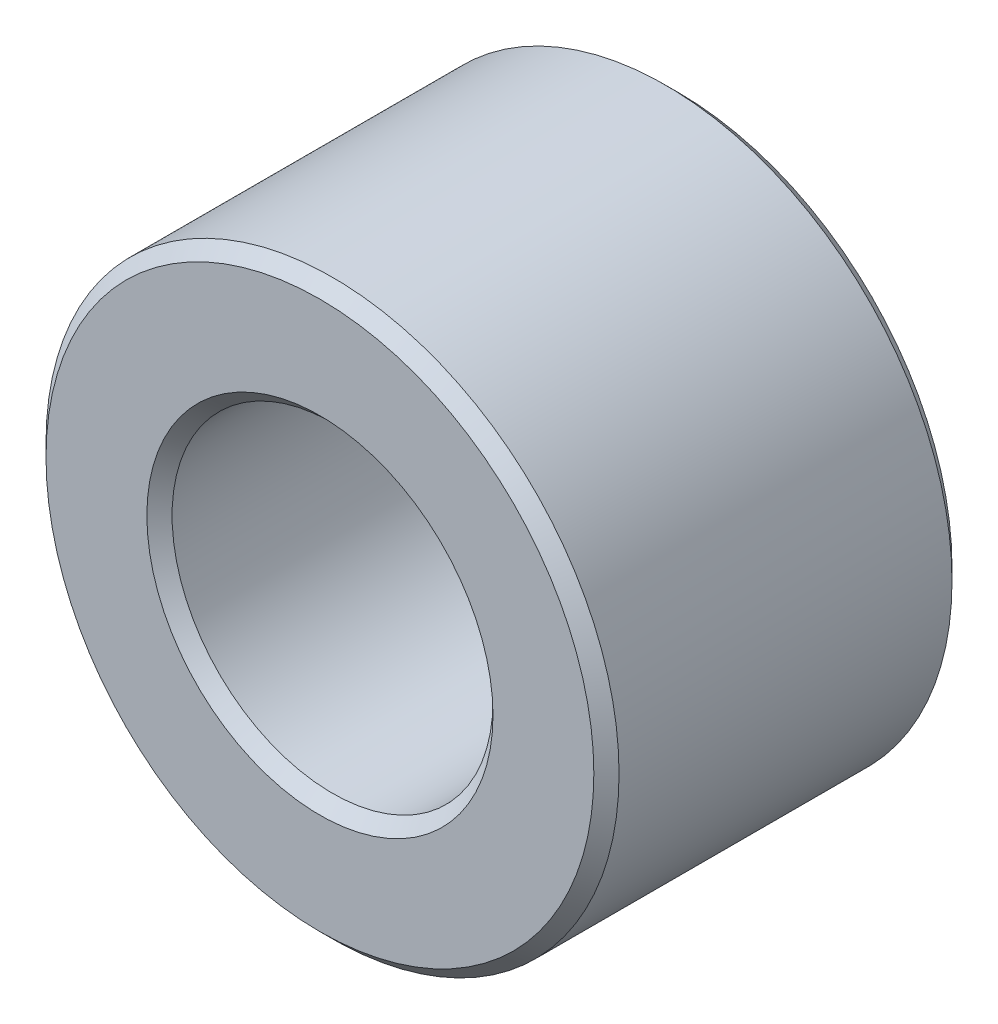
ISO-10303-21;
HEADER;
FILE_DESCRIPTION(('STEP AP214'),'2;1');
FILE_NAME('part.step','',(''),(''),'','','');
FILE_SCHEMA(('AUTOMOTIVE_DESIGN { 1 0 10303 214 1 1 1 1 }'));
ENDSEC;
DATA;
#1=APPLICATION_CONTEXT('core data for automotive mechanical design processes');
#2=APPLICATION_PROTOCOL_DEFINITION('international standard','automotive_design',2000,#1);
#3=PRODUCT_CONTEXT('',#1,'mechanical');
#4=PRODUCT('Part','Part','',(#3));
#5=PRODUCT_RELATED_PRODUCT_CATEGORY('part','',(#4));
#6=PRODUCT_DEFINITION_FORMATION('','',#4);
#7=PRODUCT_DEFINITION_CONTEXT('part definition',#1,'design');
#8=PRODUCT_DEFINITION('design','',#6,#7);
#9=PRODUCT_DEFINITION_SHAPE('','',#8);
#10=(LENGTH_UNIT() NAMED_UNIT(*) SI_UNIT(.MILLI.,.METRE.));
#11=(NAMED_UNIT(*) PLANE_ANGLE_UNIT() SI_UNIT($,.RADIAN.));
#12=(NAMED_UNIT(*) SI_UNIT($,.STERADIAN.) SOLID_ANGLE_UNIT());
#13=UNCERTAINTY_MEASURE_WITH_UNIT(LENGTH_MEASURE(1.E-05),#10,'distance_accuracy_value','');
#14=(GEOMETRIC_REPRESENTATION_CONTEXT(3) GLOBAL_UNCERTAINTY_ASSIGNED_CONTEXT((#13)) GLOBAL_UNIT_ASSIGNED_CONTEXT((#10,
#11,#12)) REPRESENTATION_CONTEXT('',''));
#15=CARTESIAN_POINT('',(0.,0.,0.));
#16=DIRECTION('',(0.,0.,1.));
#17=DIRECTION('',(1.,0.,0.));
#18=AXIS2_PLACEMENT_3D('',#15,#16,#17);
#19=CARTESIAN_POINT('',(0.,0.,-1.984375));
#20=DIRECTION('',(0.,0.,1.));
#21=DIRECTION('',(1.,0.,0.));
#22=AXIS2_PLACEMENT_3D('',#19,#20,#21);
#23=CYLINDRICAL_SURFACE('',#22,3.175);
#24=CARTESIAN_POINT('',(0.,0.,1.844675));
#25=DIRECTION('',(0.,0.,1.));
#26=DIRECTION('',(1.,0.,0.));
#27=AXIS2_PLACEMENT_3D('',#24,#25,#26);
#28=CIRCLE('',#27,3.175);
#29=CARTESIAN_POINT('',(3.175,0.,1.844675));
#30=VERTEX_POINT('',#29);
#31=EDGE_CURVE('E71',#30,#30,#28,.F.);
#32=ORIENTED_EDGE('',*,*,#31,.T.);
#33=EDGE_LOOP('',(#32));
#34=FACE_BOUND('',#33,.T.);
#35=CARTESIAN_POINT('',(0.,0.,-1.844675));
#36=DIRECTION('',(0.,0.,1.));
#37=DIRECTION('',(1.,0.,0.));
#38=AXIS2_PLACEMENT_3D('',#35,#36,#37);
#39=CIRCLE('',#38,3.175);
#40=CARTESIAN_POINT('',(3.175,0.,-1.844675));
#41=VERTEX_POINT('',#40);
#42=EDGE_CURVE('E75',#41,#41,#39,.T.);
#43=ORIENTED_EDGE('',*,*,#42,.T.);
#44=EDGE_LOOP('',(#43));
#45=FACE_BOUND('',#44,.T.);
#46=ADVANCED_FACE('F43',(#34,#45),#23,.T.);
#47=CARTESIAN_POINT('',(0.,0.,-1.984375));
#48=DIRECTION('',(0.,0.,1.));
#49=DIRECTION('',(1.,0.,0.));
#50=AXIS2_PLACEMENT_3D('',#47,#48,#49);
#51=PLANE('',#50);
#52=CARTESIAN_POINT('',(0.,0.,-1.984375));
#53=DIRECTION('',(0.,0.,1.));
#54=DIRECTION('',(1.,0.,0.));
#55=AXIS2_PLACEMENT_3D('',#52,#53,#54);
#56=CIRCLE('',#55,3.0353);
#57=CARTESIAN_POINT('',(3.0353,0.,-1.984375));
#58=VERTEX_POINT('',#57);
#59=EDGE_CURVE('E59',#58,#58,#56,.F.);
#60=ORIENTED_EDGE('',*,*,#59,.T.);
#61=EDGE_LOOP('',(#60));
#62=FACE_BOUND('',#61,.T.);
#63=CARTESIAN_POINT('',(0.,0.,-1.984375));
#64=DIRECTION('',(0.,0.,1.));
#65=DIRECTION('',(1.,0.,0.));
#66=AXIS2_PLACEMENT_3D('',#63,#64,#65);
#67=CIRCLE('',#66,1.9177);
#68=CARTESIAN_POINT('',(1.9177,0.,-1.984375));
#69=VERTEX_POINT('',#68);
#70=EDGE_CURVE('E66',#69,#69,#67,.T.);
#71=ORIENTED_EDGE('',*,*,#70,.T.);
#72=EDGE_LOOP('',(#71));
#73=FACE_BOUND('',#72,.T.);
#74=ADVANCED_FACE('F102',(#62,#73),#51,.F.);
#75=CARTESIAN_POINT('',(0.,0.,-1.984375));
#76=DIRECTION('',(0.,0.,1.));
#77=DIRECTION('',(1.,0.,0.));
#78=AXIS2_PLACEMENT_3D('',#75,#76,#77);
#79=CYLINDRICAL_SURFACE('',#78,1.778);
#80=CARTESIAN_POINT('',(0.,0.,1.844675));
#81=DIRECTION('',(0.,0.,1.));
#82=DIRECTION('',(1.,0.,0.));
#83=AXIS2_PLACEMENT_3D('',#80,#81,#82);
#84=CIRCLE('',#83,1.778);
#85=CARTESIAN_POINT('',(1.778,0.,1.844675));
#86=VERTEX_POINT('',#85);
#87=EDGE_CURVE('E10',#86,#86,#84,.T.);
#88=ORIENTED_EDGE('',*,*,#87,.T.);
#89=EDGE_LOOP('',(#88));
#90=FACE_BOUND('',#89,.T.);
#91=CARTESIAN_POINT('',(0.,0.,-1.844675));
#92=DIRECTION('',(0.,0.,1.));
#93=DIRECTION('',(1.,0.,0.));
#94=AXIS2_PLACEMENT_3D('',#91,#92,#93);
#95=CIRCLE('',#94,1.778);
#96=CARTESIAN_POINT('',(1.778,0.,-1.844675));
#97=VERTEX_POINT('',#96);
#98=EDGE_CURVE('E51',#97,#97,#95,.F.);
#99=ORIENTED_EDGE('',*,*,#98,.T.);
#100=EDGE_LOOP('',(#99));
#101=FACE_BOUND('',#100,.T.);
#102=ADVANCED_FACE('F109',(#90,#101),#79,.F.);
#103=CARTESIAN_POINT('',(0.,0.,1.984375));
#104=DIRECTION('',(0.,0.,1.));
#105=DIRECTION('',(1.,0.,0.));
#106=AXIS2_PLACEMENT_3D('',#103,#104,#105);
#107=PLANE('',#106);
#108=CARTESIAN_POINT('',(0.,0.,1.984375));
#109=DIRECTION('',(0.,0.,1.));
#110=DIRECTION('',(1.,0.,0.));
#111=AXIS2_PLACEMENT_3D('',#108,#109,#110);
#112=CIRCLE('',#111,3.0353);
#113=CARTESIAN_POINT('',(3.0353,0.,1.984375));
#114=VERTEX_POINT('',#113);
#115=EDGE_CURVE('E78',#114,#114,#112,.T.);
#116=ORIENTED_EDGE('',*,*,#115,.T.);
#117=EDGE_LOOP('',(#116));
#118=FACE_BOUND('',#117,.T.);
#119=CARTESIAN_POINT('',(0.,0.,1.984375));
#120=DIRECTION('',(0.,0.,1.));
#121=DIRECTION('',(1.,0.,0.));
#122=AXIS2_PLACEMENT_3D('',#119,#120,#121);
#123=CIRCLE('',#122,1.9177);
#124=CARTESIAN_POINT('',(1.9177,0.,1.984375));
#125=VERTEX_POINT('',#124);
#126=EDGE_CURVE('E82',#125,#125,#123,.F.);
#127=ORIENTED_EDGE('',*,*,#126,.T.);
#128=EDGE_LOOP('',(#127));
#129=FACE_BOUND('',#128,.T.);
#130=ADVANCED_FACE('F87',(#118,#129),#107,.T.);
#131=CARTESIAN_POINT('',(0.,0.,1.984375));
#132=DIRECTION('',(0.,0.,-1.));
#133=DIRECTION('',(-1.,0.,0.));
#134=AXIS2_PLACEMENT_3D('',#131,#132,#133);
#135=CONICAL_SURFACE('',#134,3.0353,0.785398163397444);
#136=ORIENTED_EDGE('',*,*,#31,.F.);
#137=EDGE_LOOP('',(#136));
#138=FACE_BOUND('',#137,.T.);
#139=ORIENTED_EDGE('',*,*,#115,.F.);
#140=EDGE_LOOP('',(#139));
#141=FACE_BOUND('',#140,.T.);
#142=ADVANCED_FACE('F98',(#138,#141),#135,.T.);
#143=CARTESIAN_POINT('',(0.,0.,-1.844675));
#144=DIRECTION('',(0.,0.,1.));
#145=DIRECTION('',(1.,0.,0.));
#146=AXIS2_PLACEMENT_3D('',#143,#144,#145);
#147=CONICAL_SURFACE('',#146,3.175,0.785398163397453);
#148=ORIENTED_EDGE('',*,*,#59,.F.);
#149=EDGE_LOOP('',(#148));
#150=FACE_BOUND('',#149,.T.);
#151=ORIENTED_EDGE('',*,*,#42,.F.);
#152=EDGE_LOOP('',(#151));
#153=FACE_BOUND('',#152,.T.);
#154=ADVANCED_FACE('F92',(#150,#153),#147,.T.);
#155=CARTESIAN_POINT('',(0.,0.,1.844675));
#156=DIRECTION('',(0.,0.,1.));
#157=DIRECTION('',(1.,0.,0.));
#158=AXIS2_PLACEMENT_3D('',#155,#156,#157);
#159=CONICAL_SURFACE('',#158,1.778,0.785398163397448);
#160=ORIENTED_EDGE('',*,*,#126,.F.);
#161=EDGE_LOOP('',(#160));
#162=FACE_BOUND('',#161,.T.);
#163=ORIENTED_EDGE('',*,*,#87,.F.);
#164=EDGE_LOOP('',(#163));
#165=FACE_BOUND('',#164,.T.);
#166=ADVANCED_FACE('F89',(#162,#165),#159,.F.);
#167=CARTESIAN_POINT('',(0.,0.,-1.984375));
#168=DIRECTION('',(0.,0.,-1.));
#169=DIRECTION('',(-1.,0.,0.));
#170=AXIS2_PLACEMENT_3D('',#167,#168,#169);
#171=CONICAL_SURFACE('',#170,1.9177,0.785398163397448);
#172=ORIENTED_EDGE('',*,*,#98,.F.);
#173=EDGE_LOOP('',(#172));
#174=FACE_BOUND('',#173,.T.);
#175=ORIENTED_EDGE('',*,*,#70,.F.);
#176=EDGE_LOOP('',(#175));
#177=FACE_BOUND('',#176,.T.);
#178=ADVANCED_FACE('F45',(#174,#177),#171,.F.);
#179=CLOSED_SHELL('',(#46,#74,#102,#130,#142,#154,#166,#178));
#180=MANIFOLD_SOLID_BREP('B2',#179);
#181=ADVANCED_BREP_SHAPE_REPRESENTATION('',(#18,#180),#14);
#182=SHAPE_DEFINITION_REPRESENTATION(#9,#181);
ENDSEC;
END-ISO-10303-21;
